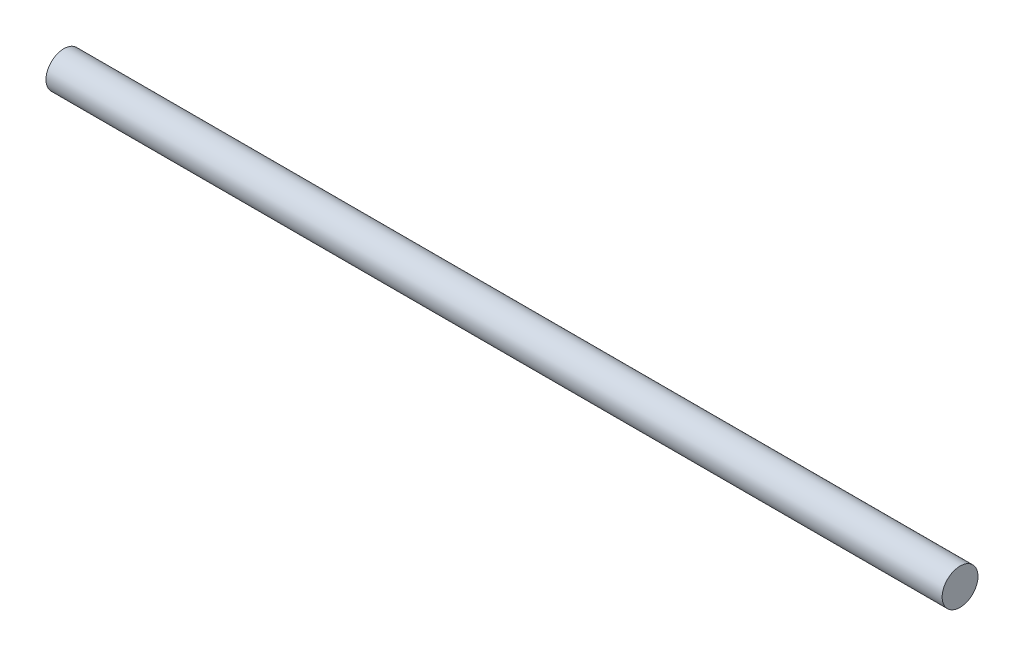
ISO-10303-21;
HEADER;
FILE_DESCRIPTION(('STEP AP214'),'2;1');
FILE_NAME('part.step','',(''),(''),'','','');
FILE_SCHEMA(('AUTOMOTIVE_DESIGN { 1 0 10303 214 1 1 1 1 }'));
ENDSEC;
DATA;
#1=APPLICATION_CONTEXT('core data for automotive mechanical design processes');
#2=APPLICATION_PROTOCOL_DEFINITION('international standard','automotive_design',2000,#1);
#3=PRODUCT_CONTEXT('',#1,'mechanical');
#4=PRODUCT('Part','Part','',(#3));
#5=PRODUCT_RELATED_PRODUCT_CATEGORY('part','',(#4));
#6=PRODUCT_DEFINITION_FORMATION('','',#4);
#7=PRODUCT_DEFINITION_CONTEXT('part definition',#1,'design');
#8=PRODUCT_DEFINITION('design','',#6,#7);
#9=PRODUCT_DEFINITION_SHAPE('','',#8);
#10=(LENGTH_UNIT() NAMED_UNIT(*) SI_UNIT(.MILLI.,.METRE.));
#11=(NAMED_UNIT(*) PLANE_ANGLE_UNIT() SI_UNIT($,.RADIAN.));
#12=(NAMED_UNIT(*) SI_UNIT($,.STERADIAN.) SOLID_ANGLE_UNIT());
#13=UNCERTAINTY_MEASURE_WITH_UNIT(LENGTH_MEASURE(1.E-05),#10,'distance_accuracy_value','');
#14=(GEOMETRIC_REPRESENTATION_CONTEXT(3) GLOBAL_UNCERTAINTY_ASSIGNED_CONTEXT((#13)) GLOBAL_UNIT_ASSIGNED_CONTEXT((#10,
#11,#12)) REPRESENTATION_CONTEXT('',''));
#15=CARTESIAN_POINT('',(0.,0.,0.));
#16=DIRECTION('',(0.,0.,1.));
#17=DIRECTION('',(1.,0.,0.));
#18=AXIS2_PLACEMENT_3D('',#15,#16,#17);
#19=CARTESIAN_POINT('',(437.5,0.,0.));
#20=DIRECTION('',(-1.,0.,0.));
#21=DIRECTION('',(0.,0.,1.));
#22=AXIS2_PLACEMENT_3D('',#19,#20,#21);
#23=CYLINDRICAL_SURFACE('',#22,17.5);
#24=CARTESIAN_POINT('',(437.5,0.,0.));
#25=DIRECTION('',(1.,0.,0.));
#26=DIRECTION('',(0.,0.,-1.));
#27=AXIS2_PLACEMENT_3D('',#24,#25,#26);
#28=CIRCLE('',#27,17.5);
#29=CARTESIAN_POINT('',(437.5,0.,-17.5));
#30=VERTEX_POINT('',#29);
#31=EDGE_CURVE('E10',#30,#30,#28,.T.);
#32=ORIENTED_EDGE('',*,*,#31,.F.);
#33=EDGE_LOOP('',(#32));
#34=FACE_BOUND('',#33,.T.);
#35=CARTESIAN_POINT('',(-437.5,0.,0.));
#36=DIRECTION('',(1.,0.,0.));
#37=DIRECTION('',(0.,0.,-1.));
#38=AXIS2_PLACEMENT_3D('',#35,#36,#37);
#39=CIRCLE('',#38,17.5);
#40=CARTESIAN_POINT('',(-437.5,0.,-17.5));
#41=VERTEX_POINT('',#40);
#42=EDGE_CURVE('E40',#41,#41,#39,.T.);
#43=ORIENTED_EDGE('',*,*,#42,.T.);
#44=EDGE_LOOP('',(#43));
#45=FACE_BOUND('',#44,.T.);
#46=ADVANCED_FACE('F37',(#34,#45),#23,.T.);
#47=CARTESIAN_POINT('',(437.5,0.,0.));
#48=DIRECTION('',(1.,0.,0.));
#49=DIRECTION('',(0.,0.,-1.));
#50=AXIS2_PLACEMENT_3D('',#47,#48,#49);
#51=PLANE('',#50);
#52=ORIENTED_EDGE('',*,*,#31,.T.);
#53=EDGE_LOOP('',(#52));
#54=FACE_BOUND('',#53,.T.);
#55=ADVANCED_FACE('F54',(#54),#51,.T.);
#56=CARTESIAN_POINT('',(-437.5,0.,0.));
#57=DIRECTION('',(1.,0.,0.));
#58=DIRECTION('',(0.,0.,-1.));
#59=AXIS2_PLACEMENT_3D('',#56,#57,#58);
#60=PLANE('',#59);
#61=ORIENTED_EDGE('',*,*,#42,.F.);
#62=EDGE_LOOP('',(#61));
#63=FACE_BOUND('',#62,.T.);
#64=ADVANCED_FACE('F52',(#63),#60,.F.);
#65=CLOSED_SHELL('',(#46,#55,#64));
#66=MANIFOLD_SOLID_BREP('B2',#65);
#67=ADVANCED_BREP_SHAPE_REPRESENTATION('',(#18,#66),#14);
#68=SHAPE_DEFINITION_REPRESENTATION(#9,#67);
ENDSEC;
END-ISO-10303-21;
